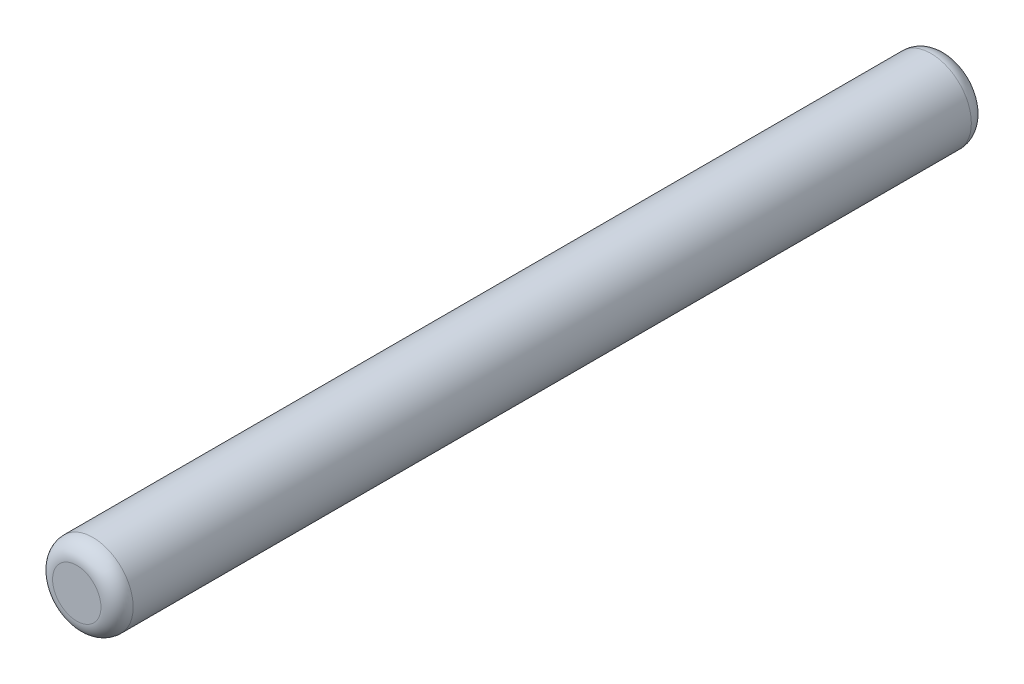
ISO-10303-21;
HEADER;
FILE_DESCRIPTION(('STEP AP214'),'2;1');
FILE_NAME('part.step','',(''),(''),'','','');
FILE_SCHEMA(('AUTOMOTIVE_DESIGN { 1 0 10303 214 1 1 1 1 }'));
ENDSEC;
DATA;
#1=APPLICATION_CONTEXT('core data for automotive mechanical design processes');
#2=APPLICATION_PROTOCOL_DEFINITION('international standard','automotive_design',2000,#1);
#3=PRODUCT_CONTEXT('',#1,'mechanical');
#4=PRODUCT('Part','Part','',(#3));
#5=PRODUCT_RELATED_PRODUCT_CATEGORY('part','',(#4));
#6=PRODUCT_DEFINITION_FORMATION('','',#4);
#7=PRODUCT_DEFINITION_CONTEXT('part definition',#1,'design');
#8=PRODUCT_DEFINITION('design','',#6,#7);
#9=PRODUCT_DEFINITION_SHAPE('','',#8);
#10=(LENGTH_UNIT() NAMED_UNIT(*) SI_UNIT(.MILLI.,.METRE.));
#11=(NAMED_UNIT(*) PLANE_ANGLE_UNIT() SI_UNIT($,.RADIAN.));
#12=(NAMED_UNIT(*) SI_UNIT($,.STERADIAN.) SOLID_ANGLE_UNIT());
#13=UNCERTAINTY_MEASURE_WITH_UNIT(LENGTH_MEASURE(1.E-05),#10,'distance_accuracy_value','');
#14=(GEOMETRIC_REPRESENTATION_CONTEXT(3) GLOBAL_UNCERTAINTY_ASSIGNED_CONTEXT((#13)) GLOBAL_UNIT_ASSIGNED_CONTEXT((#10,
#11,#12)) REPRESENTATION_CONTEXT('',''));
#15=CARTESIAN_POINT('',(0.,0.,0.));
#16=DIRECTION('',(0.,0.,1.));
#17=DIRECTION('',(1.,0.,0.));
#18=AXIS2_PLACEMENT_3D('',#15,#16,#17);
#19=CARTESIAN_POINT('',(0.,0.,54.));
#20=DIRECTION('',(0.,0.,-1.));
#21=DIRECTION('',(-1.,0.,0.));
#22=AXIS2_PLACEMENT_3D('',#19,#20,#21);
#23=CYLINDRICAL_SURFACE('',#22,2.5);
#24=CARTESIAN_POINT('',(0.,0.,1.));
#25=DIRECTION('',(0.,0.,1.));
#26=DIRECTION('',(1.,0.,0.));
#27=AXIS2_PLACEMENT_3D('',#24,#25,#26);
#28=CIRCLE('',#27,2.5);
#29=CARTESIAN_POINT('',(2.5,0.,1.));
#30=VERTEX_POINT('',#29);
#31=EDGE_CURVE('E42',#30,#30,#28,.T.);
#32=ORIENTED_EDGE('',*,*,#31,.T.);
#33=EDGE_LOOP('',(#32));
#34=FACE_BOUND('',#33,.T.);
#35=CARTESIAN_POINT('',(0.,0.,53.));
#36=DIRECTION('',(0.,0.,1.));
#37=DIRECTION('',(1.,0.,0.));
#38=AXIS2_PLACEMENT_3D('',#35,#36,#37);
#39=CIRCLE('',#38,2.5);
#40=CARTESIAN_POINT('',(2.5,0.,53.));
#41=VERTEX_POINT('',#40);
#42=EDGE_CURVE('E46',#41,#41,#39,.F.);
#43=ORIENTED_EDGE('',*,*,#42,.T.);
#44=EDGE_LOOP('',(#43));
#45=FACE_BOUND('',#44,.T.);
#46=ADVANCED_FACE('F31',(#34,#45),#23,.T.);
#47=CARTESIAN_POINT('',(0.,0.,54.));
#48=DIRECTION('',(0.,0.,1.));
#49=DIRECTION('',(1.,0.,0.));
#50=AXIS2_PLACEMENT_3D('',#47,#48,#49);
#51=PLANE('',#50);
#52=CARTESIAN_POINT('',(0.,0.,54.));
#53=DIRECTION('',(0.,0.,1.));
#54=DIRECTION('',(1.,0.,0.));
#55=AXIS2_PLACEMENT_3D('',#52,#53,#54);
#56=CIRCLE('',#55,1.5);
#57=CARTESIAN_POINT('',(1.5,0.,54.));
#58=VERTEX_POINT('',#57);
#59=EDGE_CURVE('E10',#58,#58,#56,.T.);
#60=ORIENTED_EDGE('',*,*,#59,.T.);
#61=EDGE_LOOP('',(#60));
#62=FACE_BOUND('',#61,.T.);
#63=ADVANCED_FACE('F62',(#62),#51,.T.);
#64=CARTESIAN_POINT('',(0.,0.,0.));
#65=DIRECTION('',(0.,0.,1.));
#66=DIRECTION('',(1.,0.,0.));
#67=AXIS2_PLACEMENT_3D('',#64,#65,#66);
#68=PLANE('',#67);
#69=CARTESIAN_POINT('',(0.,0.,0.));
#70=DIRECTION('',(0.,0.,1.));
#71=DIRECTION('',(1.,0.,0.));
#72=AXIS2_PLACEMENT_3D('',#69,#70,#71);
#73=CIRCLE('',#72,1.5);
#74=CARTESIAN_POINT('',(1.5,0.,0.));
#75=VERTEX_POINT('',#74);
#76=EDGE_CURVE('E38',#75,#75,#73,.F.);
#77=ORIENTED_EDGE('',*,*,#76,.T.);
#78=EDGE_LOOP('',(#77));
#79=FACE_BOUND('',#78,.T.);
#80=ADVANCED_FACE('F59',(#79),#68,.F.);
#81=CARTESIAN_POINT('',(0.,0.,1.));
#82=DIRECTION('',(0.,0.,1.));
#83=DIRECTION('',(1.,0.,0.));
#84=AXIS2_PLACEMENT_3D('',#81,#82,#83);
#85=TOROIDAL_SURFACE('',#84,1.5,1.);
#86=ORIENTED_EDGE('',*,*,#76,.F.);
#87=EDGE_LOOP('',(#86));
#88=FACE_BOUND('',#87,.T.);
#89=ORIENTED_EDGE('',*,*,#31,.F.);
#90=EDGE_LOOP('',(#89));
#91=FACE_BOUND('',#90,.T.);
#92=ADVANCED_FACE('F55',(#88,#91),#85,.T.);
#93=CARTESIAN_POINT('',(0.,0.,53.));
#94=DIRECTION('',(0.,0.,1.));
#95=DIRECTION('',(1.,0.,0.));
#96=AXIS2_PLACEMENT_3D('',#93,#94,#95);
#97=TOROIDAL_SURFACE('',#96,1.5,1.);
#98=ORIENTED_EDGE('',*,*,#42,.F.);
#99=EDGE_LOOP('',(#98));
#100=FACE_BOUND('',#99,.T.);
#101=ORIENTED_EDGE('',*,*,#59,.F.);
#102=EDGE_LOOP('',(#101));
#103=FACE_BOUND('',#102,.T.);
#104=ADVANCED_FACE('F33',(#100,#103),#97,.T.);
#105=CLOSED_SHELL('',(#46,#63,#80,#92,#104));
#106=MANIFOLD_SOLID_BREP('B2',#105);
#107=ADVANCED_BREP_SHAPE_REPRESENTATION('',(#18,#106),#14);
#108=SHAPE_DEFINITION_REPRESENTATION(#9,#107);
ENDSEC;
END-ISO-10303-21;
